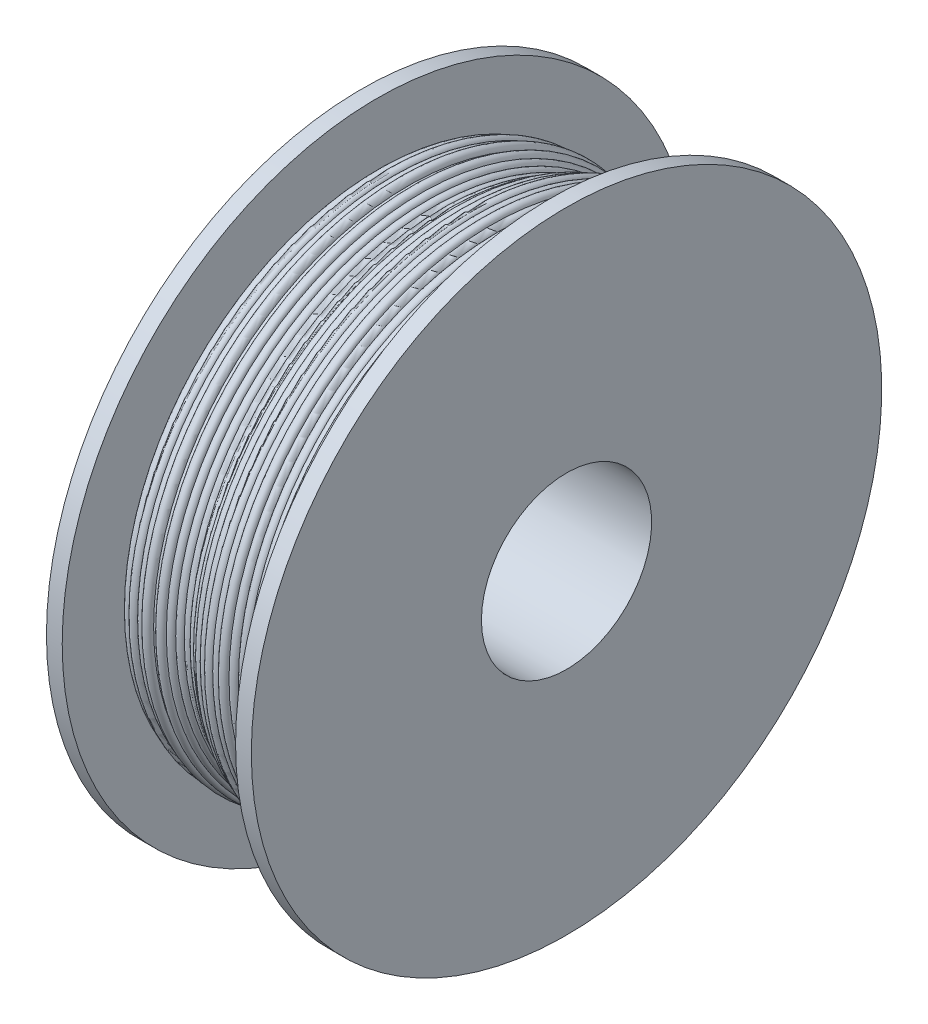
ISO-10303-21;
HEADER;
FILE_DESCRIPTION(('STEP AP214'),'2;1');
FILE_NAME('part.step','',(''),(''),'','','');
FILE_SCHEMA(('AUTOMOTIVE_DESIGN { 1 0 10303 214 1 1 1 1 }'));
ENDSEC;
DATA;
#1=APPLICATION_CONTEXT('core data for automotive mechanical design processes');
#2=APPLICATION_PROTOCOL_DEFINITION('international standard','automotive_design',2000,#1);
#3=PRODUCT_CONTEXT('',#1,'mechanical');
#4=PRODUCT('Part','Part','',(#3));
#5=PRODUCT_RELATED_PRODUCT_CATEGORY('part','',(#4));
#6=PRODUCT_DEFINITION_FORMATION('','',#4);
#7=PRODUCT_DEFINITION_CONTEXT('part definition',#1,'design');
#8=PRODUCT_DEFINITION('design','',#6,#7);
#9=PRODUCT_DEFINITION_SHAPE('','',#8);
#10=(LENGTH_UNIT() NAMED_UNIT(*) SI_UNIT(.MILLI.,.METRE.));
#11=(NAMED_UNIT(*) PLANE_ANGLE_UNIT() SI_UNIT($,.RADIAN.));
#12=(NAMED_UNIT(*) SI_UNIT($,.STERADIAN.) SOLID_ANGLE_UNIT());
#13=UNCERTAINTY_MEASURE_WITH_UNIT(LENGTH_MEASURE(1.E-05),#10,'distance_accuracy_value','');
#14=(GEOMETRIC_REPRESENTATION_CONTEXT(3) GLOBAL_UNCERTAINTY_ASSIGNED_CONTEXT((#13)) GLOBAL_UNIT_ASSIGNED_CONTEXT((#10,
#11,#12)) REPRESENTATION_CONTEXT('',''));
#15=CARTESIAN_POINT('',(0.,0.,0.));
#16=DIRECTION('',(0.,0.,1.));
#17=DIRECTION('',(1.,0.,0.));
#18=AXIS2_PLACEMENT_3D('',#15,#16,#17);
#19=CARTESIAN_POINT('',(-23.6617433821865,100.,0.));
#20=DIRECTION('',(-1.,0.,0.));
#21=DIRECTION('',(0.,0.,1.));
#22=AXIS2_PLACEMENT_3D('',#19,#20,#21);
#23=TOROIDAL_SURFACE('',#22,80.5595827222213,1.5);
#24=CARTESIAN_POINT('',(-22.3293693856808,100.,0.));
#25=DIRECTION('',(-1.,0.,0.));
#26=DIRECTION('',(0.,0.,1.));
#27=AXIS2_PLACEMENT_3D('',#24,#25,#26);
#28=CIRCLE('',#27,81.248625198006);
#29=CARTESIAN_POINT('',(-22.3293693856808,100.,81.248625198006));
#30=VERTEX_POINT('',#29);
#31=EDGE_CURVE('E11',#30,#30,#28,.T.);
#32=ORIENTED_EDGE('',*,*,#31,.T.);
#33=EDGE_LOOP('',(#32));
#34=FACE_BOUND('',#33,.T.);
#35=CARTESIAN_POINT('',(-25.1278808197424,100.,0.));
#36=DIRECTION('',(-1.,0.,0.));
#37=DIRECTION('',(0.,0.,1.));
#38=AXIS2_PLACEMENT_3D('',#35,#36,#37);
#39=CIRCLE('',#38,80.8765070257971);
#40=CARTESIAN_POINT('',(-25.1278808197424,100.,80.8765070257971));
#41=VERTEX_POINT('',#40);
#42=EDGE_CURVE('E158',#41,#41,#39,.T.);
#43=ORIENTED_EDGE('',*,*,#42,.F.);
#44=EDGE_LOOP('',(#43));
#45=FACE_BOUND('',#44,.T.);
#46=ADVANCED_FACE('F46',(#34,#45),#23,.T.);
#47=CARTESIAN_POINT('',(-21.266786362221,100.,0.));
#48=DIRECTION('',(-1.,0.,0.));
#49=DIRECTION('',(0.,0.,1.));
#50=AXIS2_PLACEMENT_3D('',#47,#48,#49);
#51=TOROIDAL_SURFACE('',#50,80.1898913701461,1.5);
#52=CARTESIAN_POINT('',(-20.5369443765171,100.,0.));
#53=DIRECTION('',(-1.,0.,0.));
#54=DIRECTION('',(0.,0.,1.));
#55=AXIS2_PLACEMENT_3D('',#52,#53,#54);
#56=CIRCLE('',#55,81.5003610095897);
#57=CARTESIAN_POINT('',(-20.5369443765171,100.,81.5003610095897));
#58=VERTEX_POINT('',#57);
#59=EDGE_CURVE('E53',#58,#58,#56,.T.);
#60=ORIENTED_EDGE('',*,*,#59,.T.);
#61=EDGE_LOOP('',(#60));
#62=FACE_BOUND('',#61,.T.);
#63=ORIENTED_EDGE('',*,*,#31,.F.);
#64=EDGE_LOOP('',(#63));
#65=FACE_BOUND('',#64,.T.);
#66=ADVANCED_FACE('F166',(#62,#65),#51,.T.);
#67=CARTESIAN_POINT('',(-19.1129323979568,100.,0.));
#68=DIRECTION('',(-1.,0.,0.));
#69=DIRECTION('',(0.,0.,1.));
#70=AXIS2_PLACEMENT_3D('',#67,#68,#69);
#71=TOROIDAL_SURFACE('',#70,81.0289907889383,1.5);
#72=CARTESIAN_POINT('',(-17.6206218326114,100.,0.));
#73=DIRECTION('',(-1.,0.,0.));
#74=DIRECTION('',(0.,0.,1.));
#75=AXIS2_PLACEMENT_3D('',#72,#73,#74);
#76=CIRCLE('',#75,80.8773030288578);
#77=CARTESIAN_POINT('',(-17.6206218326114,100.,80.8773030288578));
#78=VERTEX_POINT('',#77);
#79=EDGE_CURVE('E59',#78,#78,#76,.T.);
#80=ORIENTED_EDGE('',*,*,#79,.T.);
#81=EDGE_LOOP('',(#80));
#82=FACE_BOUND('',#81,.T.);
#83=ORIENTED_EDGE('',*,*,#59,.F.);
#84=EDGE_LOOP('',(#83));
#85=FACE_BOUND('',#84,.T.);
#86=ADVANCED_FACE('F170',(#82,#85),#71,.T.);
#87=CARTESIAN_POINT('',(-17.4573580821418,100.,0.));
#88=DIRECTION('',(-1.,0.,0.));
#89=DIRECTION('',(0.,0.,1.));
#90=AXIS2_PLACEMENT_3D('',#87,#88,#89);
#91=TOROIDAL_SURFACE('',#90,79.3862145178087,1.5);
#92=CARTESIAN_POINT('',(-16.6712943227701,100.,0.));
#93=DIRECTION('',(-1.,0.,0.));
#94=DIRECTION('',(0.,0.,1.));
#95=AXIS2_PLACEMENT_3D('',#92,#93,#94);
#96=CIRCLE('',#95,80.6637526840497);
#97=CARTESIAN_POINT('',(-16.6712943227701,100.,80.6637526840497));
#98=VERTEX_POINT('',#97);
#99=EDGE_CURVE('E64',#98,#98,#96,.T.);
#100=ORIENTED_EDGE('',*,*,#99,.T.);
#101=EDGE_LOOP('',(#100));
#102=FACE_BOUND('',#101,.T.);
#103=ORIENTED_EDGE('',*,*,#79,.F.);
#104=EDGE_LOOP('',(#103));
#105=FACE_BOUND('',#104,.T.);
#106=ADVANCED_FACE('F174',(#102,#105),#91,.T.);
#107=CARTESIAN_POINT('',(-15.1749158215036,100.,0.));
#108=DIRECTION('',(-1.,0.,0.));
#109=DIRECTION('',(0.,0.,1.));
#110=AXIS2_PLACEMENT_3D('',#107,#108,#109);
#111=TOROIDAL_SURFACE('',#110,80.5595827222213,1.5);
#112=CARTESIAN_POINT('',(-13.6900783903268,100.,0.));
#113=DIRECTION('',(-1.,0.,0.));
#114=DIRECTION('',(0.,0.,1.));
#115=AXIS2_PLACEMENT_3D('',#112,#113,#114);
#116=CIRCLE('',#115,80.7723215362075);
#117=CARTESIAN_POINT('',(-13.6900783903268,100.,80.7723215362075));
#118=VERTEX_POINT('',#117);
#119=EDGE_CURVE('E70',#118,#118,#116,.T.);
#120=ORIENTED_EDGE('',*,*,#119,.T.);
#121=EDGE_LOOP('',(#120));
#122=FACE_BOUND('',#121,.T.);
#123=ORIENTED_EDGE('',*,*,#99,.F.);
#124=EDGE_LOOP('',(#123));
#125=FACE_BOUND('',#124,.T.);
#126=ADVANCED_FACE('F181',(#122,#125),#111,.T.);
#127=CARTESIAN_POINT('',(-13.1167483513916,100.,0.));
#128=DIRECTION('',(-1.,0.,0.));
#129=DIRECTION('',(0.,0.,1.));
#130=AXIS2_PLACEMENT_3D('',#127,#128,#129);
#131=TOROIDAL_SURFACE('',#130,79.3862145178087,1.5);
#132=CARTESIAN_POINT('',(-11.6774580224451,100.,0.));
#133=DIRECTION('',(-1.,0.,0.));
#134=DIRECTION('',(0.,0.,1.));
#135=AXIS2_PLACEMENT_3D('',#132,#133,#134);
#136=CIRCLE('',#135,79.8086400721977);
#137=CARTESIAN_POINT('',(-11.6774580224451,100.,79.8086400721977));
#138=VERTEX_POINT('',#137);
#139=EDGE_CURVE('E74',#138,#138,#136,.T.);
#140=ORIENTED_EDGE('',*,*,#139,.T.);
#141=EDGE_LOOP('',(#140));
#142=FACE_BOUND('',#141,.T.);
#143=ORIENTED_EDGE('',*,*,#119,.F.);
#144=EDGE_LOOP('',(#143));
#145=FACE_BOUND('',#144,.T.);
#146=ADVANCED_FACE('F185',(#142,#145),#131,.T.);
#147=CARTESIAN_POINT('',(-10.9718411923657,100.,0.));
#148=DIRECTION('',(-1.,0.,0.));
#149=DIRECTION('',(0.,0.,1.));
#150=AXIS2_PLACEMENT_3D('',#147,#148,#149);
#151=TOROIDAL_SURFACE('',#150,78.4849690824465,1.5);
#152=CARTESIAN_POINT('',(-9.61981592292173,100.,0.));
#153=DIRECTION('',(-1.,0.,0.));
#154=DIRECTION('',(0.,0.,1.));
#155=AXIS2_PLACEMENT_3D('',#152,#153,#154);
#156=CIRCLE('',#155,79.134605650679);
#157=CARTESIAN_POINT('',(-9.61981592292173,100.,79.134605650679));
#158=VERTEX_POINT('',#157);
#159=EDGE_CURVE('E78',#158,#158,#156,.T.);
#160=ORIENTED_EDGE('',*,*,#159,.T.);
#161=EDGE_LOOP('',(#160));
#162=FACE_BOUND('',#161,.T.);
#163=ORIENTED_EDGE('',*,*,#139,.F.);
#164=EDGE_LOOP('',(#163));
#165=FACE_BOUND('',#164,.T.);
#166=ADVANCED_FACE('F189',(#162,#165),#151,.T.);
#167=CARTESIAN_POINT('',(-8.75100811620621,100.,0.));
#168=DIRECTION('',(-1.,0.,0.));
#169=DIRECTION('',(0.,0.,1.));
#170=AXIS2_PLACEMENT_3D('',#167,#168,#169);
#171=TOROIDAL_SURFACE('',#170,77.9118329837494,1.5);
#172=CARTESIAN_POINT('',(-7.72719822540894,100.,0.));
#173=DIRECTION('',(-1.,0.,0.));
#174=DIRECTION('',(0.,0.,1.));
#175=AXIS2_PLACEMENT_3D('',#172,#173,#174);
#176=CIRCLE('',#175,79.0081054441832);
#177=CARTESIAN_POINT('',(-7.72719822540894,100.,79.0081054441832));
#178=VERTEX_POINT('',#177);
#179=EDGE_CURVE('E82',#178,#178,#176,.T.);
#180=ORIENTED_EDGE('',*,*,#179,.T.);
#181=EDGE_LOOP('',(#180));
#182=FACE_BOUND('',#181,.T.);
#183=ORIENTED_EDGE('',*,*,#159,.F.);
#184=EDGE_LOOP('',(#183));
#185=FACE_BOUND('',#184,.T.);
#186=ADVANCED_FACE('F193',(#182,#185),#171,.T.);
#187=CARTESIAN_POINT('',(-6.3213787679291,100.,0.));
#188=DIRECTION('',(-1.,0.,0.));
#189=DIRECTION('',(0.,0.,1.));
#190=AXIS2_PLACEMENT_3D('',#187,#188,#189);
#191=TOROIDAL_SURFACE('',#190,78.4849690824465,1.5);
#192=CARTESIAN_POINT('',(-5.55777781826177,100.,0.));
#193=DIRECTION('',(-1.,0.,0.));
#194=DIRECTION('',(0.,0.,1.));
#195=AXIS2_PLACEMENT_3D('',#192,#193,#194);
#196=CIRCLE('',#195,79.7760591605074);
#197=CARTESIAN_POINT('',(-5.55777781826177,100.,79.7760591605074));
#198=VERTEX_POINT('',#197);
#199=EDGE_CURVE('E86',#198,#198,#196,.T.);
#200=ORIENTED_EDGE('',*,*,#199,.T.);
#201=EDGE_LOOP('',(#200));
#202=FACE_BOUND('',#201,.T.);
#203=ORIENTED_EDGE('',*,*,#179,.F.);
#204=EDGE_LOOP('',(#203));
#205=FACE_BOUND('',#204,.T.);
#206=ADVANCED_FACE('F197',(#202,#205),#191,.T.);
#207=CARTESIAN_POINT('',(-4.06258273320273,100.,0.));
#208=DIRECTION('',(-1.,0.,0.));
#209=DIRECTION('',(0.,0.,1.));
#210=AXIS2_PLACEMENT_3D('',#207,#208,#209);
#211=TOROIDAL_SURFACE('',#210,79.6560939254795,1.5);
#212=CARTESIAN_POINT('',(-3.55009349399017,100.,0.));
#213=DIRECTION('',(-1.,0.,0.));
#214=DIRECTION('',(0.,0.,1.));
#215=AXIS2_PLACEMENT_3D('',#212,#213,#214);
#216=CIRCLE('',#215,81.06582963819);
#217=CARTESIAN_POINT('',(-3.55009349399017,100.,81.06582963819));
#218=VERTEX_POINT('',#217);
#219=EDGE_CURVE('E90',#218,#218,#216,.T.);
#220=ORIENTED_EDGE('',*,*,#219,.T.);
#221=EDGE_LOOP('',(#220));
#222=FACE_BOUND('',#221,.T.);
#223=ORIENTED_EDGE('',*,*,#199,.F.);
#224=EDGE_LOOP('',(#223));
#225=FACE_BOUND('',#224,.T.);
#226=ADVANCED_FACE('F201',(#222,#225),#211,.T.);
#227=CARTESIAN_POINT('',(-2.05054592916076,100.,0.));
#228=DIRECTION('',(-1.,0.,0.));
#229=DIRECTION('',(0.,0.,1.));
#230=AXIS2_PLACEMENT_3D('',#227,#228,#229);
#231=TOROIDAL_SURFACE('',#230,81.0289907889383,1.5);
#232=CARTESIAN_POINT('',(-1.20878671542989,100.,0.));
#233=DIRECTION('',(-1.,0.,0.));
#234=DIRECTION('',(0.,0.,1.));
#235=AXIS2_PLACEMENT_3D('',#232,#233,#234);
#236=CIRCLE('',#235,82.2705387848286);
#237=CARTESIAN_POINT('',(-1.20878671542989,100.,82.2705387848286));
#238=VERTEX_POINT('',#237);
#239=EDGE_CURVE('E94',#238,#238,#236,.T.);
#240=ORIENTED_EDGE('',*,*,#239,.T.);
#241=EDGE_LOOP('',(#240));
#242=FACE_BOUND('',#241,.T.);
#243=ORIENTED_EDGE('',*,*,#219,.F.);
#244=EDGE_LOOP('',(#243));
#245=FACE_BOUND('',#244,.T.);
#246=ADVANCED_FACE('F205',(#242,#245),#231,.T.);
#247=CARTESIAN_POINT('',(0.222013348801127,100.,0.));
#248=DIRECTION('',(-1.,0.,0.));
#249=DIRECTION('',(0.,0.,1.));
#250=AXIS2_PLACEMENT_3D('',#247,#248,#249);
#251=TOROIDAL_SURFACE('',#250,81.8201931662238,1.5);
#252=CARTESIAN_POINT('',(1.15622744212091,100.,0.));
#253=DIRECTION('',(-1.,0.,0.));
#254=DIRECTION('',(0.,0.,1.));
#255=AXIS2_PLACEMENT_3D('',#252,#253,#254);
#256=CIRCLE('',#255,82.9937535727827);
#257=CARTESIAN_POINT('',(1.15622744212091,100.,82.9937535727827));
#258=VERTEX_POINT('',#257);
#259=EDGE_CURVE('E98',#258,#258,#256,.T.);
#260=ORIENTED_EDGE('',*,*,#259,.T.);
#261=EDGE_LOOP('',(#260));
#262=FACE_BOUND('',#261,.T.);
#263=ORIENTED_EDGE('',*,*,#239,.F.);
#264=EDGE_LOOP('',(#263));
#265=FACE_BOUND('',#264,.T.);
#266=ADVANCED_FACE('F209',(#262,#265),#251,.T.);
#267=CARTESIAN_POINT('',(2.65261098989647,100.,0.));
#268=DIRECTION('',(-1.,0.,0.));
#269=DIRECTION('',(0.,0.,1.));
#270=AXIS2_PLACEMENT_3D('',#267,#268,#269);
#271=TOROIDAL_SURFACE('',#270,82.8896561283057,1.5);
#272=CARTESIAN_POINT('',(3.92809951416156,100.,0.));
#273=DIRECTION('',(-1.,0.,0.));
#274=DIRECTION('',(0.,0.,1.));
#275=AXIS2_PLACEMENT_3D('',#272,#273,#274);
#276=CIRCLE('',#275,83.6790413476176);
#277=CARTESIAN_POINT('',(3.92809951416156,100.,83.6790413476176));
#278=VERTEX_POINT('',#277);
#279=EDGE_CURVE('E102',#278,#278,#276,.T.);
#280=ORIENTED_EDGE('',*,*,#279,.T.);
#281=EDGE_LOOP('',(#280));
#282=FACE_BOUND('',#281,.T.);
#283=ORIENTED_EDGE('',*,*,#259,.F.);
#284=EDGE_LOOP('',(#283));
#285=FACE_BOUND('',#284,.T.);
#286=ADVANCED_FACE('F213',(#282,#285),#271,.T.);
#287=CARTESIAN_POINT('',(4.85635285115625,100.,0.));
#288=DIRECTION('',(-1.,0.,0.));
#289=DIRECTION('',(0.,0.,1.));
#290=AXIS2_PLACEMENT_3D('',#287,#288,#289);
#291=TOROIDAL_SURFACE('',#290,82.5007605057305,1.5);
#292=CARTESIAN_POINT('',(5.77119641229743,100.,0.));
#293=DIRECTION('',(-1.,0.,0.));
#294=DIRECTION('',(0.,0.,1.));
#295=AXIS2_PLACEMENT_3D('',#292,#293,#294);
#296=CIRCLE('',#295,83.6894830379635);
#297=CARTESIAN_POINT('',(5.77119641229743,100.,83.6894830379635));
#298=VERTEX_POINT('',#297);
#299=EDGE_CURVE('E106',#298,#298,#296,.T.);
#300=ORIENTED_EDGE('',*,*,#299,.T.);
#301=EDGE_LOOP('',(#300));
#302=FACE_BOUND('',#301,.T.);
#303=ORIENTED_EDGE('',*,*,#279,.F.);
#304=EDGE_LOOP('',(#303));
#305=FACE_BOUND('',#304,.T.);
#306=ADVANCED_FACE('F217',(#302,#305),#291,.T.);
#307=CARTESIAN_POINT('',(7.04016328128468,100.,0.));
#308=DIRECTION('',(-1.,0.,0.));
#309=DIRECTION('',(0.,0.,1.));
#310=AXIS2_PLACEMENT_3D('',#307,#308,#309);
#311=TOROIDAL_SURFACE('',#310,82.8896561283057,1.5);
#312=CARTESIAN_POINT('',(8.5246884039193,100.,0.));
#313=DIRECTION('',(-1.,0.,0.));
#314=DIRECTION('',(0.,0.,1.));
#315=AXIS2_PLACEMENT_3D('',#312,#313,#314);
#316=CIRCLE('',#315,83.1045634577914);
#317=CARTESIAN_POINT('',(8.5246884039193,100.,83.1045634577914));
#318=VERTEX_POINT('',#317);
#319=EDGE_CURVE('E110',#318,#318,#316,.T.);
#320=ORIENTED_EDGE('',*,*,#319,.T.);
#321=EDGE_LOOP('',(#320));
#322=FACE_BOUND('',#321,.T.);
#323=ORIENTED_EDGE('',*,*,#299,.F.);
#324=EDGE_LOOP('',(#323));
#325=FACE_BOUND('',#324,.T.);
#326=ADVANCED_FACE('F221',(#322,#325),#311,.T.);
#327=CARTESIAN_POINT('',(9.29953868244958,100.,0.));
#328=DIRECTION('',(-1.,0.,0.));
#329=DIRECTION('',(0.,0.,1.));
#330=AXIS2_PLACEMENT_3D('',#327,#328,#329);
#331=TOROIDAL_SURFACE('',#330,81.8201931662238,1.5);
#332=CARTESIAN_POINT('',(10.7207169570842,100.,0.));
#333=DIRECTION('',(-1.,0.,0.));
#334=DIRECTION('',(0.,0.,1.));
#335=AXIS2_PLACEMENT_3D('',#332,#333,#334);
#336=CIRCLE('',#335,82.30003929959);
#337=CARTESIAN_POINT('',(10.7207169570842,100.,82.30003929959));
#338=VERTEX_POINT('',#337);
#339=EDGE_CURVE('E114',#338,#338,#336,.T.);
#340=ORIENTED_EDGE('',*,*,#339,.T.);
#341=EDGE_LOOP('',(#340));
#342=FACE_BOUND('',#341,.T.);
#343=ORIENTED_EDGE('',*,*,#319,.F.);
#344=EDGE_LOOP('',(#343));
#345=FACE_BOUND('',#344,.T.);
#346=ADVANCED_FACE('F225',(#342,#345),#331,.T.);
#347=CARTESIAN_POINT('',(11.8816819980666,100.,0.));
#348=DIRECTION('',(-1.,0.,0.));
#349=DIRECTION('',(0.,0.,1.));
#350=AXIS2_PLACEMENT_3D('',#347,#348,#349);
#351=TOROIDAL_SURFACE('',#350,81.3502181724209,1.5);
#352=CARTESIAN_POINT('',(13.1484215101863,100.,0.));
#353=DIRECTION('',(-1.,0.,0.));
#354=DIRECTION('',(0.,0.,1.));
#355=AXIS2_PLACEMENT_3D('',#352,#353,#354);
#356=CIRCLE('',#355,82.1535680391881);
#357=CARTESIAN_POINT('',(13.1484215101863,100.,82.1535680391881));
#358=VERTEX_POINT('',#357);
#359=EDGE_CURVE('E118',#358,#358,#356,.T.);
#360=ORIENTED_EDGE('',*,*,#359,.T.);
#361=EDGE_LOOP('',(#360));
#362=FACE_BOUND('',#361,.T.);
#363=ORIENTED_EDGE('',*,*,#339,.F.);
#364=EDGE_LOOP('',(#363));
#365=FACE_BOUND('',#364,.T.);
#366=ADVANCED_FACE('F229',(#362,#365),#351,.T.);
#367=CARTESIAN_POINT('',(14.1410573992315,100.,0.));
#368=DIRECTION('',(-1.,0.,0.));
#369=DIRECTION('',(0.,0.,1.));
#370=AXIS2_PLACEMENT_3D('',#367,#368,#369);
#371=TOROIDAL_SURFACE('',#370,81.0289907889383,1.5);
#372=CARTESIAN_POINT('',(14.7877309465434,100.,0.));
#373=DIRECTION('',(-1.,0.,0.));
#374=DIRECTION('',(0.,0.,1.));
#375=AXIS2_PLACEMENT_3D('',#372,#373,#374);
#376=CIRCLE('',#375,82.3824357723813);
#377=CARTESIAN_POINT('',(14.7877309465434,100.,82.3824357723813));
#378=VERTEX_POINT('',#377);
#379=EDGE_CURVE('E122',#378,#378,#376,.T.);
#380=ORIENTED_EDGE('',*,*,#379,.T.);
#381=EDGE_LOOP('',(#380));
#382=FACE_BOUND('',#381,.T.);
#383=ORIENTED_EDGE('',*,*,#359,.F.);
#384=EDGE_LOOP('',(#383));
#385=FACE_BOUND('',#384,.T.);
#386=ADVANCED_FACE('F233',(#382,#385),#371,.T.);
#387=CARTESIAN_POINT('',(16.2654927573044,100.,0.));
#388=DIRECTION('',(-1.,0.,0.));
#389=DIRECTION('',(0.,0.,1.));
#390=AXIS2_PLACEMENT_3D('',#387,#388,#389);
#391=TOROIDAL_SURFACE('',#390,82.1251032430418,1.5);
#392=CARTESIAN_POINT('',(17.5093019704967,100.,0.));
#393=DIRECTION('',(-1.,0.,0.));
#394=DIRECTION('',(0.,0.,1.));
#395=AXIS2_PLACEMENT_3D('',#392,#393,#394);
#396=CIRCLE('',#395,82.9635176043083);
#397=CARTESIAN_POINT('',(17.5093019704967,100.,82.9635176043083));
#398=VERTEX_POINT('',#397);
#399=EDGE_CURVE('E126',#398,#398,#396,.T.);
#400=ORIENTED_EDGE('',*,*,#399,.T.);
#401=EDGE_LOOP('',(#400));
#402=FACE_BOUND('',#401,.T.);
#403=ORIENTED_EDGE('',*,*,#379,.F.);
#404=EDGE_LOOP('',(#403));
#405=FACE_BOUND('',#404,.T.);
#406=ADVANCED_FACE('F237',(#402,#405),#391,.T.);
#407=CARTESIAN_POINT('',(18.753111183689,100.,0.));
#408=DIRECTION('',(-1.,0.,0.));
#409=DIRECTION('',(0.,0.,1.));
#410=AXIS2_PLACEMENT_3D('',#407,#408,#409);
#411=TOROIDAL_SURFACE('',#410,82.1251032430418,1.5);
#412=CARTESIAN_POINT('',(20.1036560184811,100.,0.));
#413=DIRECTION('',(-1.,0.,0.));
#414=DIRECTION('',(0.,0.,1.));
#415=AXIS2_PLACEMENT_3D('',#412,#413,#414);
#416=CIRCLE('',#415,82.777811944697);
#417=CARTESIAN_POINT('',(20.1036560184811,100.,82.777811944697));
#418=VERTEX_POINT('',#417);
#419=EDGE_CURVE('E130',#418,#418,#416,.T.);
#420=ORIENTED_EDGE('',*,*,#419,.T.);
#421=EDGE_LOOP('',(#420));
#422=FACE_BOUND('',#421,.T.);
#423=ORIENTED_EDGE('',*,*,#399,.F.);
#424=EDGE_LOOP('',(#423));
#425=FACE_BOUND('',#424,.T.);
#426=ADVANCED_FACE('F241',(#422,#425),#411,.T.);
#427=CARTESIAN_POINT('',(21.0921326801499,100.,0.));
#428=DIRECTION('',(-1.,0.,0.));
#429=DIRECTION('',(0.,0.,1.));
#430=AXIS2_PLACEMENT_3D('',#427,#428,#429);
#431=TOROIDAL_SURFACE('',#430,81.6495770891213,1.5);
#432=CARTESIAN_POINT('',(22.4781408180085,100.,0.));
#433=DIRECTION('',(-1.,0.,0.));
#434=DIRECTION('',(0.,0.,1.));
#435=AXIS2_PLACEMENT_3D('',#432,#433,#434);
#436=CIRCLE('',#435,82.2231461275025);
#437=CARTESIAN_POINT('',(22.4781408180085,100.,82.2231461275025));
#438=VERTEX_POINT('',#437);
#439=EDGE_CURVE('E134',#438,#438,#436,.T.);
#440=ORIENTED_EDGE('',*,*,#439,.T.);
#441=EDGE_LOOP('',(#440));
#442=FACE_BOUND('',#441,.T.);
#443=ORIENTED_EDGE('',*,*,#419,.F.);
#444=EDGE_LOOP('',(#443));
#445=FACE_BOUND('',#444,.T.);
#446=ADVANCED_FACE('F245',(#442,#445),#431,.T.);
#447=CARTESIAN_POINT('',(23.3858814348032,100.,0.));
#448=DIRECTION('',(-1.,0.,0.));
#449=DIRECTION('',(0.,0.,1.));
#450=AXIS2_PLACEMENT_3D('',#447,#448,#449);
#451=TOROIDAL_SURFACE('',#450,81.0289907889383,1.5);
#452=CARTESIAN_POINT('',(24.7547954104259,100.,0.));
#453=DIRECTION('',(-1.,0.,0.));
#454=DIRECTION('',(0.,0.,1.));
#455=AXIS2_PLACEMENT_3D('',#452,#453,#454);
#456=CIRCLE('',#455,81.6422399449465);
#457=CARTESIAN_POINT('',(24.7547954104259,100.,81.6422399449465));
#458=VERTEX_POINT('',#457);
#459=EDGE_CURVE('E138',#458,#458,#456,.T.);
#460=ORIENTED_EDGE('',*,*,#459,.T.);
#461=EDGE_LOOP('',(#460));
#462=FACE_BOUND('',#461,.T.);
#463=ORIENTED_EDGE('',*,*,#439,.F.);
#464=EDGE_LOOP('',(#463));
#465=FACE_BOUND('',#464,.T.);
#466=ADVANCED_FACE('F249',(#462,#465),#451,.T.);
#467=CARTESIAN_POINT('',(26.,100.,0.));
#468=DIRECTION('',(-1.,0.,0.));
#469=DIRECTION('',(0.,0.,1.));
#470=AXIS2_PLACEMENT_3D('',#467,#468,#469);
#471=TOROIDAL_SURFACE('',#470,80.8058993862603,1.5);
#472=CARTESIAN_POINT('',(27.5,100.,0.));
#473=DIRECTION('',(-1.,0.,0.));
#474=DIRECTION('',(0.,0.,1.));
#475=AXIS2_PLACEMENT_3D('',#472,#473,#474);
#476=CIRCLE('',#475,80.8058993862603);
#477=CARTESIAN_POINT('',(27.5,100.,80.8058993862603));
#478=VERTEX_POINT('',#477);
#479=EDGE_CURVE('E142',#478,#478,#476,.T.);
#480=ORIENTED_EDGE('',*,*,#479,.T.);
#481=EDGE_LOOP('',(#480));
#482=FACE_BOUND('',#481,.T.);
#483=ORIENTED_EDGE('',*,*,#459,.F.);
#484=EDGE_LOOP('',(#483));
#485=FACE_BOUND('',#484,.T.);
#486=ADVANCED_FACE('F253',(#482,#485),#471,.T.);
#487=CARTESIAN_POINT('',(27.5,68.,0.));
#488=DIRECTION('',(1.,0.,0.));
#489=DIRECTION('',(0.,0.,-1.));
#490=AXIS2_PLACEMENT_3D('',#487,#488,#489);
#491=PLANE('',#490);
#492=CARTESIAN_POINT('',(27.5,100.,0.));
#493=DIRECTION('',(-1.,0.,0.));
#494=DIRECTION('',(0.,0.,1.));
#495=AXIS2_PLACEMENT_3D('',#492,#493,#494);
#496=CIRCLE('',#495,32.);
#497=CARTESIAN_POINT('',(27.5,100.,32.));
#498=VERTEX_POINT('',#497);
#499=EDGE_CURVE('E146',#498,#498,#496,.T.);
#500=ORIENTED_EDGE('',*,*,#499,.T.);
#501=EDGE_LOOP('',(#500));
#502=FACE_BOUND('',#501,.T.);
#503=ORIENTED_EDGE('',*,*,#479,.F.);
#504=EDGE_LOOP('',(#503));
#505=FACE_BOUND('',#504,.T.);
#506=ADVANCED_FACE('F257',(#502,#505),#491,.T.);
#507=CARTESIAN_POINT('',(-32.5,100.,0.));
#508=DIRECTION('',(-1.,0.,0.));
#509=DIRECTION('',(0.,0.,1.));
#510=AXIS2_PLACEMENT_3D('',#507,#508,#509);
#511=CYLINDRICAL_SURFACE('',#510,32.);
#512=CARTESIAN_POINT('',(-27.5,100.,0.));
#513=DIRECTION('',(-1.,0.,0.));
#514=DIRECTION('',(0.,0.,1.));
#515=AXIS2_PLACEMENT_3D('',#512,#513,#514);
#516=CIRCLE('',#515,32.);
#517=CARTESIAN_POINT('',(-27.5,100.,32.));
#518=VERTEX_POINT('',#517);
#519=EDGE_CURVE('E150',#518,#518,#516,.T.);
#520=ORIENTED_EDGE('',*,*,#519,.T.);
#521=EDGE_LOOP('',(#520));
#522=FACE_BOUND('',#521,.T.);
#523=ORIENTED_EDGE('',*,*,#499,.F.);
#524=EDGE_LOOP('',(#523));
#525=FACE_BOUND('',#524,.T.);
#526=ADVANCED_FACE('F261',(#522,#525),#511,.F.);
#527=CARTESIAN_POINT('',(-27.5,20.3439060745205,0.));
#528=DIRECTION('',(-1.,0.,0.));
#529=DIRECTION('',(0.,0.,1.));
#530=AXIS2_PLACEMENT_3D('',#527,#528,#529);
#531=PLANE('',#530);
#532=CARTESIAN_POINT('',(-27.5,100.,0.));
#533=DIRECTION('',(-1.,0.,0.));
#534=DIRECTION('',(0.,0.,1.));
#535=AXIS2_PLACEMENT_3D('',#532,#533,#534);
#536=CIRCLE('',#535,79.6560939254795);
#537=CARTESIAN_POINT('',(-27.5,100.,79.6560939254795));
#538=VERTEX_POINT('',#537);
#539=EDGE_CURVE('E154',#538,#538,#536,.T.);
#540=ORIENTED_EDGE('',*,*,#539,.T.);
#541=EDGE_LOOP('',(#540));
#542=FACE_BOUND('',#541,.T.);
#543=ORIENTED_EDGE('',*,*,#519,.F.);
#544=EDGE_LOOP('',(#543));
#545=FACE_BOUND('',#544,.T.);
#546=ADVANCED_FACE('F265',(#542,#545),#531,.T.);
#547=CARTESIAN_POINT('',(-26.,100.,0.));
#548=DIRECTION('',(-1.,0.,0.));
#549=DIRECTION('',(0.,0.,1.));
#550=AXIS2_PLACEMENT_3D('',#547,#548,#549);
#551=TOROIDAL_SURFACE('',#550,79.6560939254795,1.5);
#552=ORIENTED_EDGE('',*,*,#42,.T.);
#553=EDGE_LOOP('',(#552));
#554=FACE_BOUND('',#553,.T.);
#555=ORIENTED_EDGE('',*,*,#539,.F.);
#556=EDGE_LOOP('',(#555));
#557=FACE_BOUND('',#556,.T.);
#558=ADVANCED_FACE('F162',(#554,#557),#551,.T.);
#559=CLOSED_SHELL('',(#46,#66,#86,#106,#126,#146,#166,#186,#206,#226,#246,#266,#286,#306,#326,
#346,#366,#386,#406,#426,#446,#466,#486,#506,#526,#546,#558));
#560=MANIFOLD_SOLID_BREP('B2',#559);
#561=CARTESIAN_POINT('',(-54.8790144880569,100.,0.));
#562=DIRECTION('',(-1.,0.,0.));
#563=DIRECTION('',(0.,0.,1.));
#564=AXIS2_PLACEMENT_3D('',#561,#562,#563);
#565=CYLINDRICAL_SURFACE('',#564,100.);
#566=CARTESIAN_POINT('',(-27.5,100.,0.));
#567=DIRECTION('',(-1.,0.,0.));
#568=DIRECTION('',(0.,0.,1.));
#569=AXIS2_PLACEMENT_3D('',#566,#567,#568);
#570=CIRCLE('',#569,100.);
#571=CARTESIAN_POINT('',(-27.5,100.,100.));
#572=VERTEX_POINT('',#571);
#573=EDGE_CURVE('E45',#572,#572,#570,.T.);
#574=ORIENTED_EDGE('',*,*,#573,.T.);
#575=EDGE_LOOP('',(#574));
#576=FACE_BOUND('',#575,.T.);
#577=CARTESIAN_POINT('',(-32.5,100.,0.));
#578=DIRECTION('',(-1.,0.,0.));
#579=DIRECTION('',(0.,0.,1.));
#580=AXIS2_PLACEMENT_3D('',#577,#578,#579);
#581=CIRCLE('',#580,100.);
#582=CARTESIAN_POINT('',(-32.5,100.,100.));
#583=VERTEX_POINT('',#582);
#584=EDGE_CURVE('E542',#583,#583,#581,.T.);
#585=ORIENTED_EDGE('',*,*,#584,.F.);
#586=EDGE_LOOP('',(#585));
#587=FACE_BOUND('',#586,.T.);
#588=ADVANCED_FACE('F506',(#576,#587),#565,.T.);
#589=CARTESIAN_POINT('',(-27.5,0.,0.));
#590=DIRECTION('',(1.,0.,0.));
#591=DIRECTION('',(0.,0.,-1.));
#592=AXIS2_PLACEMENT_3D('',#589,#590,#591);
#593=PLANE('',#592);
#594=CARTESIAN_POINT('',(-27.5,100.,0.));
#595=DIRECTION('',(-1.,0.,0.));
#596=DIRECTION('',(0.,0.,1.));
#597=AXIS2_PLACEMENT_3D('',#594,#595,#596);
#598=CIRCLE('',#597,32.);
#599=CARTESIAN_POINT('',(-27.5,100.,32.));
#600=VERTEX_POINT('',#599);
#601=EDGE_CURVE('E513',#600,#600,#598,.T.);
#602=ORIENTED_EDGE('',*,*,#601,.T.);
#603=EDGE_LOOP('',(#602));
#604=FACE_BOUND('',#603,.T.);
#605=ORIENTED_EDGE('',*,*,#573,.F.);
#606=EDGE_LOOP('',(#605));
#607=FACE_BOUND('',#606,.T.);
#608=ADVANCED_FACE('F550',(#604,#607),#593,.T.);
#609=CARTESIAN_POINT('',(-54.8790144880569,100.,0.));
#610=DIRECTION('',(-1.,0.,0.));
#611=DIRECTION('',(0.,0.,1.));
#612=AXIS2_PLACEMENT_3D('',#609,#610,#611);
#613=CYLINDRICAL_SURFACE('',#612,32.);
#614=CARTESIAN_POINT('',(27.5,100.,0.));
#615=DIRECTION('',(-1.,0.,0.));
#616=DIRECTION('',(0.,0.,1.));
#617=AXIS2_PLACEMENT_3D('',#614,#615,#616);
#618=CIRCLE('',#617,32.);
#619=CARTESIAN_POINT('',(27.5,100.,32.));
#620=VERTEX_POINT('',#619);
#621=EDGE_CURVE('E519',#620,#620,#618,.T.);
#622=ORIENTED_EDGE('',*,*,#621,.T.);
#623=EDGE_LOOP('',(#622));
#624=FACE_BOUND('',#623,.T.);
#625=ORIENTED_EDGE('',*,*,#601,.F.);
#626=EDGE_LOOP('',(#625));
#627=FACE_BOUND('',#626,.T.);
#628=ADVANCED_FACE('F554',(#624,#627),#613,.T.);
#629=CARTESIAN_POINT('',(27.5,68.,0.));
#630=DIRECTION('',(-1.,0.,0.));
#631=DIRECTION('',(0.,0.,1.));
#632=AXIS2_PLACEMENT_3D('',#629,#630,#631);
#633=PLANE('',#632);
#634=CARTESIAN_POINT('',(27.5,100.,0.));
#635=DIRECTION('',(-1.,0.,0.));
#636=DIRECTION('',(0.,0.,1.));
#637=AXIS2_PLACEMENT_3D('',#634,#635,#636);
#638=CIRCLE('',#637,100.);
#639=CARTESIAN_POINT('',(27.5,100.,100.));
#640=VERTEX_POINT('',#639);
#641=EDGE_CURVE('E525',#640,#640,#638,.T.);
#642=ORIENTED_EDGE('',*,*,#641,.T.);
#643=EDGE_LOOP('',(#642));
#644=FACE_BOUND('',#643,.T.);
#645=ORIENTED_EDGE('',*,*,#621,.F.);
#646=EDGE_LOOP('',(#645));
#647=FACE_BOUND('',#646,.T.);
#648=ADVANCED_FACE('F558',(#644,#647),#633,.T.);
#649=CARTESIAN_POINT('',(-54.8790144880569,100.,0.));
#650=DIRECTION('',(-1.,0.,0.));
#651=DIRECTION('',(0.,0.,1.));
#652=AXIS2_PLACEMENT_3D('',#649,#650,#651);
#653=CYLINDRICAL_SURFACE('',#652,100.);
#654=CARTESIAN_POINT('',(32.5,100.,0.));
#655=DIRECTION('',(-1.,0.,0.));
#656=DIRECTION('',(0.,0.,1.));
#657=AXIS2_PLACEMENT_3D('',#654,#655,#656);
#658=CIRCLE('',#657,100.);
#659=CARTESIAN_POINT('',(32.5,100.,100.));
#660=VERTEX_POINT('',#659);
#661=EDGE_CURVE('E531',#660,#660,#658,.T.);
#662=ORIENTED_EDGE('',*,*,#661,.T.);
#663=EDGE_LOOP('',(#662));
#664=FACE_BOUND('',#663,.T.);
#665=ORIENTED_EDGE('',*,*,#641,.F.);
#666=EDGE_LOOP('',(#665));
#667=FACE_BOUND('',#666,.T.);
#668=ADVANCED_FACE('F565',(#664,#667),#653,.T.);
#669=CARTESIAN_POINT('',(32.5,0.,0.));
#670=DIRECTION('',(1.,0.,0.));
#671=DIRECTION('',(0.,0.,-1.));
#672=AXIS2_PLACEMENT_3D('',#669,#670,#671);
#673=PLANE('',#672);
#674=CARTESIAN_POINT('',(32.5,100.,0.));
#675=DIRECTION('',(-1.,0.,0.));
#676=DIRECTION('',(0.,0.,1.));
#677=AXIS2_PLACEMENT_3D('',#674,#675,#676);
#678=CIRCLE('',#677,27.);
#679=CARTESIAN_POINT('',(32.5,100.,27.));
#680=VERTEX_POINT('',#679);
#681=EDGE_CURVE('E535',#680,#680,#678,.T.);
#682=ORIENTED_EDGE('',*,*,#681,.T.);
#683=EDGE_LOOP('',(#682));
#684=FACE_BOUND('',#683,.T.);
#685=ORIENTED_EDGE('',*,*,#661,.F.);
#686=EDGE_LOOP('',(#685));
#687=FACE_BOUND('',#686,.T.);
#688=ADVANCED_FACE('F569',(#684,#687),#673,.T.);
#689=CARTESIAN_POINT('',(-54.8790144880569,100.,0.));
#690=DIRECTION('',(-1.,0.,0.));
#691=DIRECTION('',(0.,0.,1.));
#692=AXIS2_PLACEMENT_3D('',#689,#690,#691);
#693=CYLINDRICAL_SURFACE('',#692,27.);
#694=CARTESIAN_POINT('',(-32.5,100.,0.));
#695=DIRECTION('',(-1.,0.,0.));
#696=DIRECTION('',(0.,0.,1.));
#697=AXIS2_PLACEMENT_3D('',#694,#695,#696);
#698=CIRCLE('',#697,27.);
#699=CARTESIAN_POINT('',(-32.5,100.,27.));
#700=VERTEX_POINT('',#699);
#701=EDGE_CURVE('E539',#700,#700,#698,.T.);
#702=ORIENTED_EDGE('',*,*,#701,.T.);
#703=EDGE_LOOP('',(#702));
#704=FACE_BOUND('',#703,.T.);
#705=ORIENTED_EDGE('',*,*,#681,.F.);
#706=EDGE_LOOP('',(#705));
#707=FACE_BOUND('',#706,.T.);
#708=ADVANCED_FACE('F573',(#704,#707),#693,.F.);
#709=CARTESIAN_POINT('',(-32.5,73.,0.));
#710=DIRECTION('',(-1.,0.,0.));
#711=DIRECTION('',(0.,0.,1.));
#712=AXIS2_PLACEMENT_3D('',#709,#710,#711);
#713=PLANE('',#712);
#714=ORIENTED_EDGE('',*,*,#584,.T.);
#715=EDGE_LOOP('',(#714));
#716=FACE_BOUND('',#715,.T.);
#717=ORIENTED_EDGE('',*,*,#701,.F.);
#718=EDGE_LOOP('',(#717));
#719=FACE_BOUND('',#718,.T.);
#720=ADVANCED_FACE('F546',(#716,#719),#713,.T.);
#721=CLOSED_SHELL('',(#588,#608,#628,#648,#668,#688,#708,#720));
#722=MANIFOLD_SOLID_BREP('B6',#721);
#723=ADVANCED_BREP_SHAPE_REPRESENTATION('',(#18,#560,#722),#14);
#724=SHAPE_DEFINITION_REPRESENTATION(#9,#723);
ENDSEC;
END-ISO-10303-21;
